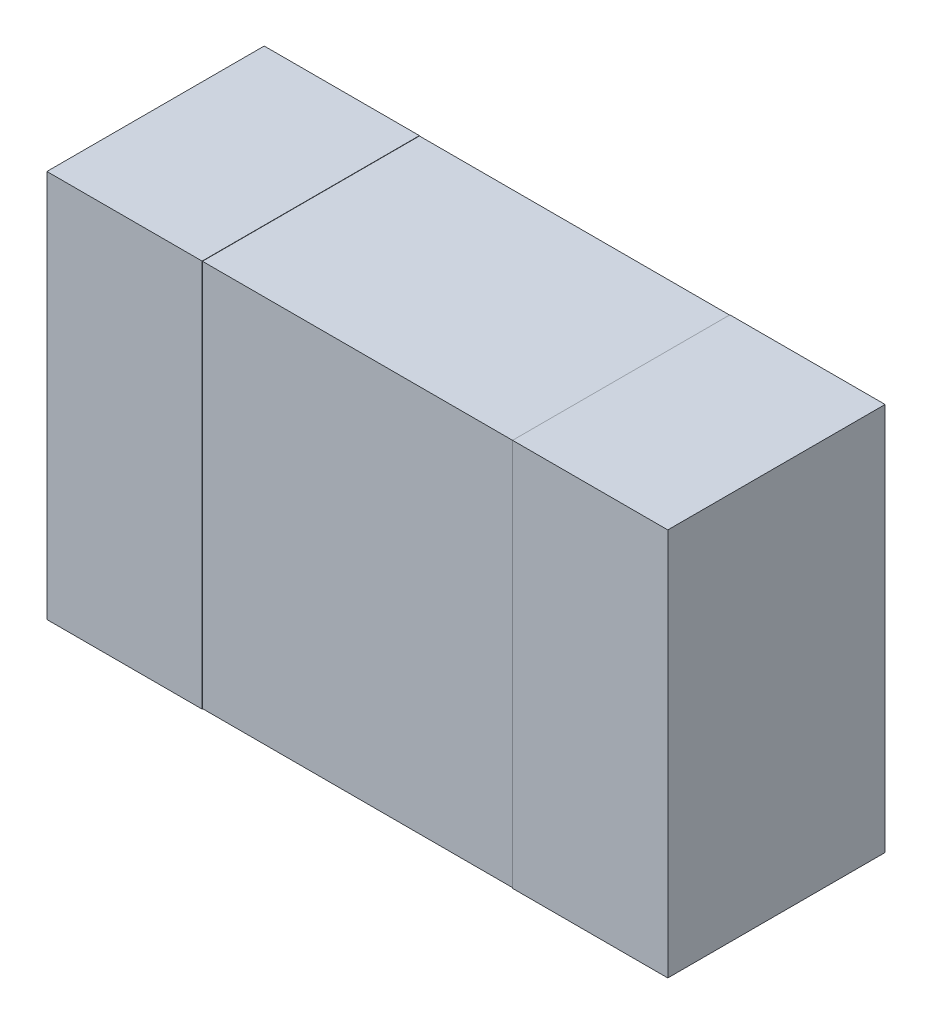
ISO-10303-21;
HEADER;
FILE_DESCRIPTION(('STEP AP214'),'2;1');
FILE_NAME('part.step','',(''),(''),'','','');
FILE_SCHEMA(('AUTOMOTIVE_DESIGN { 1 0 10303 214 1 1 1 1 }'));
ENDSEC;
DATA;
#1=APPLICATION_CONTEXT('core data for automotive mechanical design processes');
#2=APPLICATION_PROTOCOL_DEFINITION('international standard','automotive_design',2000,#1);
#3=PRODUCT_CONTEXT('',#1,'mechanical');
#4=PRODUCT('Part','Part','',(#3));
#5=PRODUCT_RELATED_PRODUCT_CATEGORY('part','',(#4));
#6=PRODUCT_DEFINITION_FORMATION('','',#4);
#7=PRODUCT_DEFINITION_CONTEXT('part definition',#1,'design');
#8=PRODUCT_DEFINITION('design','',#6,#7);
#9=PRODUCT_DEFINITION_SHAPE('','',#8);
#10=(LENGTH_UNIT() NAMED_UNIT(*) SI_UNIT(.MILLI.,.METRE.));
#11=(NAMED_UNIT(*) PLANE_ANGLE_UNIT() SI_UNIT($,.RADIAN.));
#12=(NAMED_UNIT(*) SI_UNIT($,.STERADIAN.) SOLID_ANGLE_UNIT());
#13=UNCERTAINTY_MEASURE_WITH_UNIT(LENGTH_MEASURE(1.E-05),#10,'distance_accuracy_value','');
#14=(GEOMETRIC_REPRESENTATION_CONTEXT(3) GLOBAL_UNCERTAINTY_ASSIGNED_CONTEXT((#13)) GLOBAL_UNIT_ASSIGNED_CONTEXT((#10,
#11,#12)) REPRESENTATION_CONTEXT('',''));
#15=CARTESIAN_POINT('',(0.,0.,0.));
#16=DIRECTION('',(0.,0.,1.));
#17=DIRECTION('',(1.,0.,0.));
#18=AXIS2_PLACEMENT_3D('',#15,#16,#17);
#19=CARTESIAN_POINT('',(0.5,-0.625,0.699));
#20=DIRECTION('',(0.,0.,-1.));
#21=DIRECTION('',(-1.,0.,0.));
#22=AXIS2_PLACEMENT_3D('',#19,#20,#21);
#23=PLANE('',#22);
#24=DIRECTION('',(0.,1.,0.));
#25=VECTOR('',#24,1.);
#26=CARTESIAN_POINT('',(0.5,-0.625,0.699));
#27=LINE('',#26,#25);
#28=CARTESIAN_POINT('',(0.5,-0.624,0.699));
#29=VERTEX_POINT('',#28);
#30=CARTESIAN_POINT('',(0.5,0.624,0.699));
#31=VERTEX_POINT('',#30);
#32=EDGE_CURVE('E211',#29,#31,#27,.T.);
#33=ORIENTED_EDGE('',*,*,#32,.T.);
#34=DIRECTION('',(-1.,0.,0.));
#35=VECTOR('',#34,1.);
#36=CARTESIAN_POINT('',(0.5,0.624,0.699));
#37=LINE('',#36,#35);
#38=CARTESIAN_POINT('',(-0.5,0.624,0.699));
#39=VERTEX_POINT('',#38);
#40=EDGE_CURVE('E210',#31,#39,#37,.T.);
#41=ORIENTED_EDGE('',*,*,#40,.T.);
#42=DIRECTION('',(0.,1.,0.));
#43=VECTOR('',#42,1.);
#44=CARTESIAN_POINT('',(-0.5,-0.625,0.699));
#45=LINE('',#44,#43);
#46=CARTESIAN_POINT('',(-0.5,-0.624,0.699));
#47=VERTEX_POINT('',#46);
#48=EDGE_CURVE('E192',#47,#39,#45,.T.);
#49=ORIENTED_EDGE('',*,*,#48,.F.);
#50=DIRECTION('',(-1.,0.,0.));
#51=VECTOR('',#50,1.);
#52=CARTESIAN_POINT('',(0.5,-0.624,0.699));
#53=LINE('',#52,#51);
#54=EDGE_CURVE('E11',#29,#47,#53,.T.);
#55=ORIENTED_EDGE('',*,*,#54,.F.);
#56=EDGE_LOOP('',(#33,#41,#49,#55));
#57=FACE_BOUND('',#56,.T.);
#58=ADVANCED_FACE('F16',(#57),#23,.F.);
#59=CARTESIAN_POINT('',(0.5,-0.624,0.7));
#60=DIRECTION('',(0.,1.,0.));
#61=DIRECTION('',(1.,0.,0.));
#62=AXIS2_PLACEMENT_3D('',#59,#60,#61);
#63=PLANE('',#62);
#64=DIRECTION('',(0.,0.,-1.));
#65=VECTOR('',#64,1.);
#66=CARTESIAN_POINT('',(0.5,-0.624,0.7));
#67=LINE('',#66,#65);
#68=CARTESIAN_POINT('',(0.5,-0.624,0.));
#69=VERTEX_POINT('',#68);
#70=EDGE_CURVE('E27',#29,#69,#67,.T.);
#71=ORIENTED_EDGE('',*,*,#70,.F.);
#72=ORIENTED_EDGE('',*,*,#54,.T.);
#73=DIRECTION('',(0.,0.,-1.));
#74=VECTOR('',#73,1.);
#75=CARTESIAN_POINT('',(-0.5,-0.624,0.7));
#76=LINE('',#75,#74);
#77=CARTESIAN_POINT('',(-0.5,-0.624,0.));
#78=VERTEX_POINT('',#77);
#79=EDGE_CURVE('E76',#47,#78,#76,.T.);
#80=ORIENTED_EDGE('',*,*,#79,.T.);
#81=DIRECTION('',(1.,0.,0.));
#82=VECTOR('',#81,1.);
#83=CARTESIAN_POINT('',(0.5,-0.624,0.));
#84=LINE('',#83,#82);
#85=EDGE_CURVE('E226',#78,#69,#84,.T.);
#86=ORIENTED_EDGE('',*,*,#85,.T.);
#87=EDGE_LOOP('',(#71,#72,#80,#86));
#88=FACE_BOUND('',#87,.T.);
#89=ADVANCED_FACE('F403',(#88),#63,.F.);
#90=CARTESIAN_POINT('',(0.5,0.625,0.7));
#91=DIRECTION('',(1.,-1.084202172485E-13,0.));
#92=DIRECTION('',(-1.084202172485E-13,-1.,0.));
#93=AXIS2_PLACEMENT_3D('',#90,#91,#92);
#94=PLANE('',#93);
#95=DIRECTION('',(-1.084202172485E-13,-1.,0.));
#96=VECTOR('',#95,1.);
#97=CARTESIAN_POINT('',(0.5,0.625,0.));
#98=LINE('',#97,#96);
#99=CARTESIAN_POINT('',(0.5,0.625,0.));
#100=VERTEX_POINT('',#99);
#101=CARTESIAN_POINT('',(0.5,0.624,0.));
#102=VERTEX_POINT('',#101);
#103=EDGE_CURVE('E243',#100,#102,#98,.T.);
#104=ORIENTED_EDGE('',*,*,#103,.T.);
#105=DIRECTION('',(0.,0.,-1.));
#106=VECTOR('',#105,1.);
#107=CARTESIAN_POINT('',(0.5,0.624,0.7));
#108=LINE('',#107,#106);
#109=EDGE_CURVE('E214',#31,#102,#108,.T.);
#110=ORIENTED_EDGE('',*,*,#109,.F.);
#111=ORIENTED_EDGE('',*,*,#32,.F.);
#112=ORIENTED_EDGE('',*,*,#70,.T.);
#113=DIRECTION('',(0.,-1.,0.));
#114=VECTOR('',#113,1.);
#115=CARTESIAN_POINT('',(0.5,-0.624,0.));
#116=LINE('',#115,#114);
#117=CARTESIAN_POINT('',(0.5,-0.625,0.));
#118=VERTEX_POINT('',#117);
#119=EDGE_CURVE('E91',#69,#118,#116,.T.);
#120=ORIENTED_EDGE('',*,*,#119,.T.);
#121=DIRECTION('',(0.,0.,-1.));
#122=VECTOR('',#121,1.);
#123=CARTESIAN_POINT('',(0.5,-0.625,0.7));
#124=LINE('',#123,#122);
#125=CARTESIAN_POINT('',(0.5,-0.625,0.7));
#126=VERTEX_POINT('',#125);
#127=EDGE_CURVE('E185',#126,#118,#124,.T.);
#128=ORIENTED_EDGE('',*,*,#127,.F.);
#129=DIRECTION('',(-1.084202172485E-13,-1.,0.));
#130=VECTOR('',#129,1.);
#131=CARTESIAN_POINT('',(0.5,0.625,0.7));
#132=LINE('',#131,#130);
#133=CARTESIAN_POINT('',(0.5,0.625,0.7));
#134=VERTEX_POINT('',#133);
#135=EDGE_CURVE('E223',#134,#126,#132,.T.);
#136=ORIENTED_EDGE('',*,*,#135,.F.);
#137=DIRECTION('',(0.,0.,-1.));
#138=VECTOR('',#137,1.);
#139=CARTESIAN_POINT('',(0.5,0.625,0.7));
#140=LINE('',#139,#138);
#141=EDGE_CURVE('E203',#134,#100,#140,.T.);
#142=ORIENTED_EDGE('',*,*,#141,.T.);
#143=EDGE_LOOP('',(#104,#110,#111,#112,#120,#128,#136,#142));
#144=FACE_BOUND('',#143,.T.);
#145=ADVANCED_FACE('F286',(#144),#94,.F.);
#146=CARTESIAN_POINT('',(0.5,0.624,0.7));
#147=DIRECTION('',(0.,-1.,0.));
#148=DIRECTION('',(0.,0.,-1.));
#149=AXIS2_PLACEMENT_3D('',#146,#147,#148);
#150=PLANE('',#149);
#151=DIRECTION('',(0.,0.,-1.));
#152=VECTOR('',#151,1.);
#153=CARTESIAN_POINT('',(-0.5,0.624,0.7));
#154=LINE('',#153,#152);
#155=CARTESIAN_POINT('',(-0.5,0.624,0.));
#156=VERTEX_POINT('',#155);
#157=EDGE_CURVE('E207',#39,#156,#154,.T.);
#158=ORIENTED_EDGE('',*,*,#157,.F.);
#159=ORIENTED_EDGE('',*,*,#40,.F.);
#160=ORIENTED_EDGE('',*,*,#109,.T.);
#161=DIRECTION('',(-1.,0.,0.));
#162=VECTOR('',#161,1.);
#163=CARTESIAN_POINT('',(0.5,0.624,0.));
#164=LINE('',#163,#162);
#165=EDGE_CURVE('E235',#102,#156,#164,.T.);
#166=ORIENTED_EDGE('',*,*,#165,.T.);
#167=EDGE_LOOP('',(#158,#159,#160,#166));
#168=FACE_BOUND('',#167,.T.);
#169=ADVANCED_FACE('F18',(#168),#150,.F.);
#170=CARTESIAN_POINT('',(-0.5,0.625,0.7));
#171=DIRECTION('',(-1.,-1.084202172485E-13,0.));
#172=DIRECTION('',(-1.084202172485E-13,1.,0.));
#173=AXIS2_PLACEMENT_3D('',#170,#171,#172);
#174=PLANE('',#173);
#175=DIRECTION('',(-1.084202172485E-13,1.,0.));
#176=VECTOR('',#175,1.);
#177=CARTESIAN_POINT('',(-0.5,0.625,0.));
#178=LINE('',#177,#176);
#179=CARTESIAN_POINT('',(-0.5,0.625,0.));
#180=VERTEX_POINT('',#179);
#181=EDGE_CURVE('E232',#156,#180,#178,.T.);
#182=ORIENTED_EDGE('',*,*,#181,.T.);
#183=DIRECTION('',(0.,0.,-1.));
#184=VECTOR('',#183,1.);
#185=CARTESIAN_POINT('',(-0.5,0.625,0.7));
#186=LINE('',#185,#184);
#187=CARTESIAN_POINT('',(-0.5,0.625,0.7));
#188=VERTEX_POINT('',#187);
#189=EDGE_CURVE('E183',#188,#180,#186,.T.);
#190=ORIENTED_EDGE('',*,*,#189,.F.);
#191=DIRECTION('',(-1.084202172485E-13,1.,0.));
#192=VECTOR('',#191,1.);
#193=CARTESIAN_POINT('',(-0.5,0.625,0.7));
#194=LINE('',#193,#192);
#195=CARTESIAN_POINT('',(-0.5,-0.625,0.7));
#196=VERTEX_POINT('',#195);
#197=EDGE_CURVE('E164',#196,#188,#194,.T.);
#198=ORIENTED_EDGE('',*,*,#197,.F.);
#199=DIRECTION('',(0.,0.,-1.));
#200=VECTOR('',#199,1.);
#201=CARTESIAN_POINT('',(-0.5,-0.625,0.7));
#202=LINE('',#201,#200);
#203=CARTESIAN_POINT('',(-0.5,-0.625,0.));
#204=VERTEX_POINT('',#203);
#205=EDGE_CURVE('E184',#196,#204,#202,.T.);
#206=ORIENTED_EDGE('',*,*,#205,.T.);
#207=DIRECTION('',(0.,1.,0.));
#208=VECTOR('',#207,1.);
#209=CARTESIAN_POINT('',(-0.5,-0.624,0.));
#210=LINE('',#209,#208);
#211=EDGE_CURVE('E229',#204,#78,#210,.T.);
#212=ORIENTED_EDGE('',*,*,#211,.T.);
#213=ORIENTED_EDGE('',*,*,#79,.F.);
#214=ORIENTED_EDGE('',*,*,#48,.T.);
#215=ORIENTED_EDGE('',*,*,#157,.T.);
#216=EDGE_LOOP('',(#182,#190,#198,#206,#212,#213,#214,#215));
#217=FACE_BOUND('',#216,.T.);
#218=ADVANCED_FACE('F431',(#217),#174,.F.);
#219=CARTESIAN_POINT('',(0.,0.,0.));
#220=DIRECTION('',(0.,0.,1.));
#221=DIRECTION('',(1.,0.,0.));
#222=AXIS2_PLACEMENT_3D('',#219,#220,#221);
#223=PLANE('',#222);
#224=ORIENTED_EDGE('',*,*,#85,.F.);
#225=ORIENTED_EDGE('',*,*,#211,.F.);
#226=DIRECTION('',(1.,0.,0.));
#227=VECTOR('',#226,1.);
#228=CARTESIAN_POINT('',(-1.,-0.625,0.));
#229=LINE('',#228,#227);
#230=CARTESIAN_POINT('',(-1.,-0.625,0.));
#231=VERTEX_POINT('',#230);
#232=EDGE_CURVE('E160',#231,#204,#229,.T.);
#233=ORIENTED_EDGE('',*,*,#232,.F.);
#234=DIRECTION('',(0.,-1.,0.));
#235=VECTOR('',#234,1.);
#236=CARTESIAN_POINT('',(-1.,0.625,0.));
#237=LINE('',#236,#235);
#238=CARTESIAN_POINT('',(-1.,0.625,0.));
#239=VERTEX_POINT('',#238);
#240=EDGE_CURVE('E202',#239,#231,#237,.T.);
#241=ORIENTED_EDGE('',*,*,#240,.F.);
#242=DIRECTION('',(-1.,0.,0.));
#243=VECTOR('',#242,1.);
#244=CARTESIAN_POINT('',(-1.,0.625,0.));
#245=LINE('',#244,#243);
#246=EDGE_CURVE('E146',#180,#239,#245,.T.);
#247=ORIENTED_EDGE('',*,*,#246,.F.);
#248=ORIENTED_EDGE('',*,*,#181,.F.);
#249=ORIENTED_EDGE('',*,*,#165,.F.);
#250=ORIENTED_EDGE('',*,*,#103,.F.);
#251=DIRECTION('',(-1.,0.,0.));
#252=VECTOR('',#251,1.);
#253=CARTESIAN_POINT('',(-1.,0.625,0.));
#254=LINE('',#253,#252);
#255=CARTESIAN_POINT('',(1.,0.625,0.));
#256=VERTEX_POINT('',#255);
#257=EDGE_CURVE('E20',#256,#100,#254,.T.);
#258=ORIENTED_EDGE('',*,*,#257,.F.);
#259=DIRECTION('',(0.,1.,0.));
#260=VECTOR('',#259,1.);
#261=CARTESIAN_POINT('',(1.,0.625,0.));
#262=LINE('',#261,#260);
#263=CARTESIAN_POINT('',(1.,-0.625,0.));
#264=VERTEX_POINT('',#263);
#265=EDGE_CURVE('E149',#264,#256,#262,.T.);
#266=ORIENTED_EDGE('',*,*,#265,.F.);
#267=DIRECTION('',(1.,0.,0.));
#268=VECTOR('',#267,1.);
#269=CARTESIAN_POINT('',(-1.,-0.625,0.));
#270=LINE('',#269,#268);
#271=EDGE_CURVE('E189',#118,#264,#270,.T.);
#272=ORIENTED_EDGE('',*,*,#271,.F.);
#273=ORIENTED_EDGE('',*,*,#119,.F.);
#274=EDGE_LOOP('',(#224,#225,#233,#241,#247,#248,#249,#250,#258,#266,#272,#273));
#275=FACE_BOUND('',#274,.T.);
#276=ADVANCED_FACE('F293',(#275),#223,.F.);
#277=CARTESIAN_POINT('',(0.,0.,0.7));
#278=DIRECTION('',(0.,0.,1.));
#279=DIRECTION('',(1.,0.,0.));
#280=AXIS2_PLACEMENT_3D('',#277,#278,#279);
#281=PLANE('',#280);
#282=ORIENTED_EDGE('',*,*,#135,.T.);
#283=DIRECTION('',(1.,0.,0.));
#284=VECTOR('',#283,1.);
#285=CARTESIAN_POINT('',(-1.,-0.625,0.7));
#286=LINE('',#285,#284);
#287=CARTESIAN_POINT('',(1.,-0.625,0.7));
#288=VERTEX_POINT('',#287);
#289=EDGE_CURVE('E190',#126,#288,#286,.T.);
#290=ORIENTED_EDGE('',*,*,#289,.T.);
#291=DIRECTION('',(0.,1.,0.));
#292=VECTOR('',#291,1.);
#293=CARTESIAN_POINT('',(1.,0.625,0.7));
#294=LINE('',#293,#292);
#295=CARTESIAN_POINT('',(1.,0.625,0.7));
#296=VERTEX_POINT('',#295);
#297=EDGE_CURVE('E180',#288,#296,#294,.T.);
#298=ORIENTED_EDGE('',*,*,#297,.T.);
#299=DIRECTION('',(-1.,0.,0.));
#300=VECTOR('',#299,1.);
#301=CARTESIAN_POINT('',(-1.,0.625,0.7));
#302=LINE('',#301,#300);
#303=EDGE_CURVE('E198',#296,#134,#302,.T.);
#304=ORIENTED_EDGE('',*,*,#303,.T.);
#305=EDGE_LOOP('',(#282,#290,#298,#304));
#306=FACE_BOUND('',#305,.T.);
#307=ADVANCED_FACE('F277',(#306),#281,.T.);
#308=CARTESIAN_POINT('',(-1.,-0.625,0.7));
#309=DIRECTION('',(0.,1.,0.));
#310=DIRECTION('',(1.,0.,0.));
#311=AXIS2_PLACEMENT_3D('',#308,#309,#310);
#312=PLANE('',#311);
#313=ORIENTED_EDGE('',*,*,#289,.F.);
#314=ORIENTED_EDGE('',*,*,#127,.T.);
#315=ORIENTED_EDGE('',*,*,#271,.T.);
#316=DIRECTION('',(0.,0.,-1.));
#317=VECTOR('',#316,1.);
#318=CARTESIAN_POINT('',(1.,-0.625,0.7));
#319=LINE('',#318,#317);
#320=EDGE_CURVE('E194',#288,#264,#319,.T.);
#321=ORIENTED_EDGE('',*,*,#320,.F.);
#322=EDGE_LOOP('',(#313,#314,#315,#321));
#323=FACE_BOUND('',#322,.T.);
#324=ADVANCED_FACE('F290',(#323),#312,.F.);
#325=CARTESIAN_POINT('',(-1.,0.625,0.7));
#326=DIRECTION('',(1.,0.,0.));
#327=DIRECTION('',(0.,1.,0.));
#328=AXIS2_PLACEMENT_3D('',#325,#326,#327);
#329=PLANE('',#328);
#330=ORIENTED_EDGE('',*,*,#240,.T.);
#331=DIRECTION('',(0.,0.,-1.));
#332=VECTOR('',#331,1.);
#333=CARTESIAN_POINT('',(-1.,-0.625,0.7));
#334=LINE('',#333,#332);
#335=CARTESIAN_POINT('',(-1.,-0.625,0.7));
#336=VERTEX_POINT('',#335);
#337=EDGE_CURVE('E155',#336,#231,#334,.T.);
#338=ORIENTED_EDGE('',*,*,#337,.F.);
#339=DIRECTION('',(0.,-1.,0.));
#340=VECTOR('',#339,1.);
#341=CARTESIAN_POINT('',(-1.,0.625,0.7));
#342=LINE('',#341,#340);
#343=CARTESIAN_POINT('',(-1.,0.625,0.7));
#344=VERTEX_POINT('',#343);
#345=EDGE_CURVE('E152',#344,#336,#342,.T.);
#346=ORIENTED_EDGE('',*,*,#345,.F.);
#347=DIRECTION('',(0.,0.,-1.));
#348=VECTOR('',#347,1.);
#349=CARTESIAN_POINT('',(-1.,0.625,0.7));
#350=LINE('',#349,#348);
#351=EDGE_CURVE('E138',#344,#239,#350,.T.);
#352=ORIENTED_EDGE('',*,*,#351,.T.);
#353=EDGE_LOOP('',(#330,#338,#346,#352));
#354=FACE_BOUND('',#353,.T.);
#355=ADVANCED_FACE('F153',(#354),#329,.F.);
#356=CARTESIAN_POINT('',(-1.,0.625,0.7));
#357=DIRECTION('',(0.,-1.,0.));
#358=DIRECTION('',(0.,0.,-1.));
#359=AXIS2_PLACEMENT_3D('',#356,#357,#358);
#360=PLANE('',#359);
#361=ORIENTED_EDGE('',*,*,#257,.T.);
#362=ORIENTED_EDGE('',*,*,#141,.F.);
#363=ORIENTED_EDGE('',*,*,#303,.F.);
#364=DIRECTION('',(0.,0.,-1.));
#365=VECTOR('',#364,1.);
#366=CARTESIAN_POINT('',(1.,0.625,0.7));
#367=LINE('',#366,#365);
#368=EDGE_CURVE('E176',#296,#256,#367,.T.);
#369=ORIENTED_EDGE('',*,*,#368,.T.);
#370=EDGE_LOOP('',(#361,#362,#363,#369));
#371=FACE_BOUND('',#370,.T.);
#372=ADVANCED_FACE('F284',(#371),#360,.F.);
#373=CARTESIAN_POINT('',(1.,0.625,0.7));
#374=DIRECTION('',(-1.,0.,0.));
#375=DIRECTION('',(0.,0.,1.));
#376=AXIS2_PLACEMENT_3D('',#373,#374,#375);
#377=PLANE('',#376);
#378=ORIENTED_EDGE('',*,*,#265,.T.);
#379=ORIENTED_EDGE('',*,*,#368,.F.);
#380=ORIENTED_EDGE('',*,*,#297,.F.);
#381=ORIENTED_EDGE('',*,*,#320,.T.);
#382=EDGE_LOOP('',(#378,#379,#380,#381));
#383=FACE_BOUND('',#382,.T.);
#384=ADVANCED_FACE('F280',(#383),#377,.F.);
#385=CARTESIAN_POINT('',(-1.,0.625,0.7));
#386=DIRECTION('',(0.,-1.,0.));
#387=DIRECTION('',(0.,0.,-1.));
#388=AXIS2_PLACEMENT_3D('',#385,#386,#387);
#389=PLANE('',#388);
#390=DIRECTION('',(-1.,0.,0.));
#391=VECTOR('',#390,1.);
#392=CARTESIAN_POINT('',(-1.,0.625,0.7));
#393=LINE('',#392,#391);
#394=EDGE_CURVE('E143',#188,#344,#393,.T.);
#395=ORIENTED_EDGE('',*,*,#394,.F.);
#396=ORIENTED_EDGE('',*,*,#189,.T.);
#397=ORIENTED_EDGE('',*,*,#246,.T.);
#398=ORIENTED_EDGE('',*,*,#351,.F.);
#399=EDGE_LOOP('',(#395,#396,#397,#398));
#400=FACE_BOUND('',#399,.T.);
#401=ADVANCED_FACE('F140',(#400),#389,.F.);
#402=CARTESIAN_POINT('',(-1.,-0.625,0.7));
#403=DIRECTION('',(0.,1.,0.));
#404=DIRECTION('',(1.,0.,0.));
#405=AXIS2_PLACEMENT_3D('',#402,#403,#404);
#406=PLANE('',#405);
#407=ORIENTED_EDGE('',*,*,#232,.T.);
#408=ORIENTED_EDGE('',*,*,#205,.F.);
#409=DIRECTION('',(1.,0.,0.));
#410=VECTOR('',#409,1.);
#411=CARTESIAN_POINT('',(-1.,-0.625,0.7));
#412=LINE('',#411,#410);
#413=EDGE_CURVE('E171',#336,#196,#412,.T.);
#414=ORIENTED_EDGE('',*,*,#413,.F.);
#415=ORIENTED_EDGE('',*,*,#337,.T.);
#416=EDGE_LOOP('',(#407,#408,#414,#415));
#417=FACE_BOUND('',#416,.T.);
#418=ADVANCED_FACE('F434',(#417),#406,.F.);
#419=CARTESIAN_POINT('',(0.,0.,0.7));
#420=DIRECTION('',(0.,0.,1.));
#421=DIRECTION('',(1.,0.,0.));
#422=AXIS2_PLACEMENT_3D('',#419,#420,#421);
#423=PLANE('',#422);
#424=ORIENTED_EDGE('',*,*,#413,.T.);
#425=ORIENTED_EDGE('',*,*,#197,.T.);
#426=ORIENTED_EDGE('',*,*,#394,.T.);
#427=ORIENTED_EDGE('',*,*,#345,.T.);
#428=EDGE_LOOP('',(#424,#425,#426,#427));
#429=FACE_BOUND('',#428,.T.);
#430=ADVANCED_FACE('F162',(#429),#423,.T.);
#431=CLOSED_SHELL('',(#58,#89,#145,#169,#218,#276,#307,#324,#355,#372,#384,#401,#418,#430));
#432=MANIFOLD_SOLID_BREP('B1',#431);
#433=ADVANCED_BREP_SHAPE_REPRESENTATION('',(#18,#432),#14);
#434=SHAPE_DEFINITION_REPRESENTATION(#9,#433);
ENDSEC;
END-ISO-10303-21;
